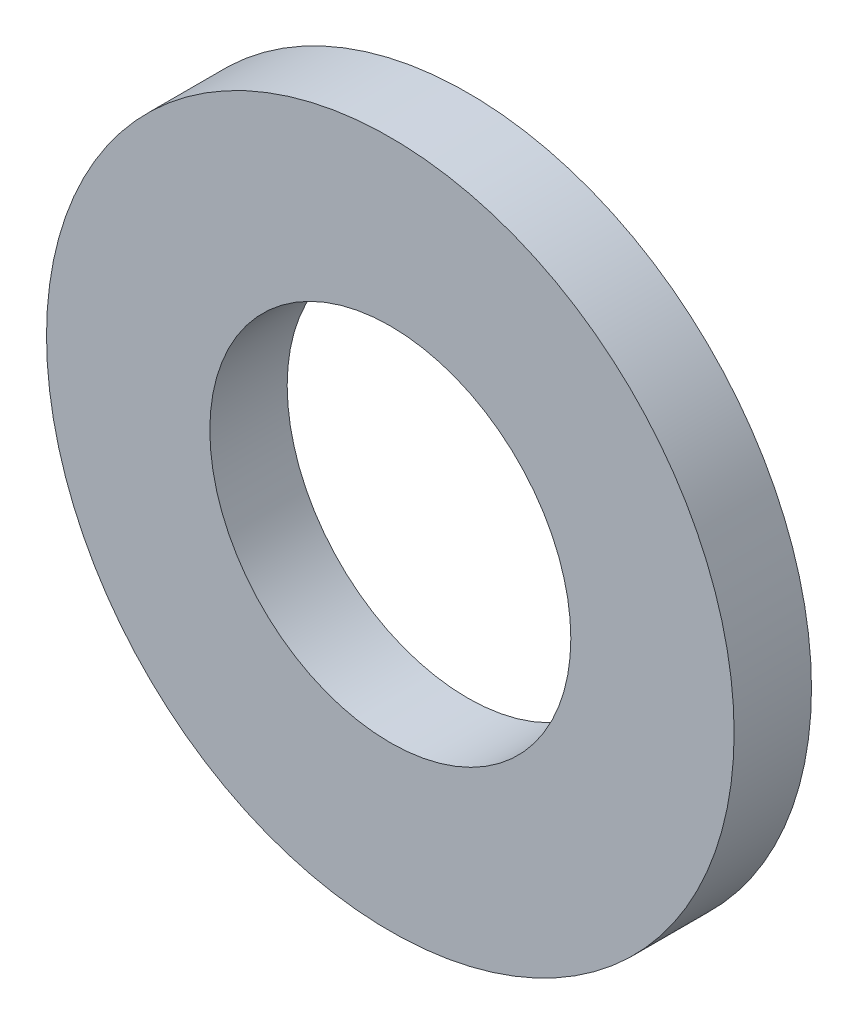
ISO-10303-21;
HEADER;
FILE_DESCRIPTION(('STEP AP214'),'2;1');
FILE_NAME('part.step','',(''),(''),'','','');
FILE_SCHEMA(('AUTOMOTIVE_DESIGN { 1 0 10303 214 1 1 1 1 }'));
ENDSEC;
DATA;
#1=APPLICATION_CONTEXT('core data for automotive mechanical design processes');
#2=APPLICATION_PROTOCOL_DEFINITION('international standard','automotive_design',2000,#1);
#3=PRODUCT_CONTEXT('',#1,'mechanical');
#4=PRODUCT('Part','Part','',(#3));
#5=PRODUCT_RELATED_PRODUCT_CATEGORY('part','',(#4));
#6=PRODUCT_DEFINITION_FORMATION('','',#4);
#7=PRODUCT_DEFINITION_CONTEXT('part definition',#1,'design');
#8=PRODUCT_DEFINITION('design','',#6,#7);
#9=PRODUCT_DEFINITION_SHAPE('','',#8);
#10=(LENGTH_UNIT() NAMED_UNIT(*) SI_UNIT(.MILLI.,.METRE.));
#11=(NAMED_UNIT(*) PLANE_ANGLE_UNIT() SI_UNIT($,.RADIAN.));
#12=(NAMED_UNIT(*) SI_UNIT($,.STERADIAN.) SOLID_ANGLE_UNIT());
#13=UNCERTAINTY_MEASURE_WITH_UNIT(LENGTH_MEASURE(1.E-05),#10,'distance_accuracy_value','');
#14=(GEOMETRIC_REPRESENTATION_CONTEXT(3) GLOBAL_UNCERTAINTY_ASSIGNED_CONTEXT((#13)) GLOBAL_UNIT_ASSIGNED_CONTEXT((#10,
#11,#12)) REPRESENTATION_CONTEXT('',''));
#15=CARTESIAN_POINT('',(0.,0.,0.));
#16=DIRECTION('',(0.,0.,1.));
#17=DIRECTION('',(1.,0.,0.));
#18=AXIS2_PLACEMENT_3D('',#15,#16,#17);
#19=CARTESIAN_POINT('',(0.,0.,1.8));
#20=DIRECTION('',(0.,0.,1.));
#21=DIRECTION('',(1.,0.,0.));
#22=AXIS2_PLACEMENT_3D('',#19,#20,#21);
#23=PLANE('',#22);
#24=CARTESIAN_POINT('',(0.,0.,1.8));
#25=DIRECTION('',(0.,0.,1.));
#26=DIRECTION('',(1.,0.,0.));
#27=AXIS2_PLACEMENT_3D('',#24,#25,#26);
#28=CIRCLE('',#27,8.);
#29=CARTESIAN_POINT('',(8.,0.,1.8));
#30=VERTEX_POINT('',#29);
#31=EDGE_CURVE('E10',#30,#30,#28,.T.);
#32=ORIENTED_EDGE('',*,*,#31,.T.);
#33=EDGE_LOOP('',(#32));
#34=FACE_BOUND('',#33,.T.);
#35=CARTESIAN_POINT('',(0.,0.,1.8));
#36=DIRECTION('',(0.,0.,1.));
#37=DIRECTION('',(1.,0.,0.));
#38=AXIS2_PLACEMENT_3D('',#35,#36,#37);
#39=CIRCLE('',#38,4.2);
#40=CARTESIAN_POINT('',(4.2,0.,1.8));
#41=VERTEX_POINT('',#40);
#42=EDGE_CURVE('E48',#41,#41,#39,.T.);
#43=ORIENTED_EDGE('',*,*,#42,.F.);
#44=EDGE_LOOP('',(#43));
#45=FACE_BOUND('',#44,.T.);
#46=ADVANCED_FACE('F37',(#34,#45),#23,.T.);
#47=CARTESIAN_POINT('',(0.,0.,0.));
#48=DIRECTION('',(0.,0.,1.));
#49=DIRECTION('',(1.,0.,0.));
#50=AXIS2_PLACEMENT_3D('',#47,#48,#49);
#51=PLANE('',#50);
#52=CARTESIAN_POINT('',(0.,0.,0.));
#53=DIRECTION('',(0.,0.,1.));
#54=DIRECTION('',(1.,0.,0.));
#55=AXIS2_PLACEMENT_3D('',#52,#53,#54);
#56=CIRCLE('',#55,8.);
#57=CARTESIAN_POINT('',(8.,0.,0.));
#58=VERTEX_POINT('',#57);
#59=EDGE_CURVE('E41',#58,#58,#56,.T.);
#60=ORIENTED_EDGE('',*,*,#59,.F.);
#61=EDGE_LOOP('',(#60));
#62=FACE_BOUND('',#61,.T.);
#63=CARTESIAN_POINT('',(0.,0.,0.));
#64=DIRECTION('',(0.,0.,1.));
#65=DIRECTION('',(1.,0.,0.));
#66=AXIS2_PLACEMENT_3D('',#63,#64,#65);
#67=CIRCLE('',#66,4.2);
#68=CARTESIAN_POINT('',(4.2,0.,0.));
#69=VERTEX_POINT('',#68);
#70=EDGE_CURVE('E50',#69,#69,#67,.T.);
#71=ORIENTED_EDGE('',*,*,#70,.T.);
#72=EDGE_LOOP('',(#71));
#73=FACE_BOUND('',#72,.T.);
#74=ADVANCED_FACE('F60',(#62,#73),#51,.F.);
#75=CARTESIAN_POINT('',(0.,0.,1.8));
#76=DIRECTION('',(0.,0.,-1.));
#77=DIRECTION('',(-1.,0.,0.));
#78=AXIS2_PLACEMENT_3D('',#75,#76,#77);
#79=CYLINDRICAL_SURFACE('',#78,8.);
#80=ORIENTED_EDGE('',*,*,#31,.F.);
#81=EDGE_LOOP('',(#80));
#82=FACE_BOUND('',#81,.T.);
#83=ORIENTED_EDGE('',*,*,#59,.T.);
#84=EDGE_LOOP('',(#83));
#85=FACE_BOUND('',#84,.T.);
#86=ADVANCED_FACE('F39',(#82,#85),#79,.T.);
#87=CARTESIAN_POINT('',(0.,0.,1.8));
#88=DIRECTION('',(0.,0.,-1.));
#89=DIRECTION('',(-1.,0.,0.));
#90=AXIS2_PLACEMENT_3D('',#87,#88,#89);
#91=CYLINDRICAL_SURFACE('',#90,4.2);
#92=ORIENTED_EDGE('',*,*,#42,.T.);
#93=EDGE_LOOP('',(#92));
#94=FACE_BOUND('',#93,.T.);
#95=ORIENTED_EDGE('',*,*,#70,.F.);
#96=EDGE_LOOP('',(#95));
#97=FACE_BOUND('',#96,.T.);
#98=ADVANCED_FACE('F56',(#94,#97),#91,.F.);
#99=CLOSED_SHELL('',(#46,#74,#86,#98));
#100=MANIFOLD_SOLID_BREP('B2',#99);
#101=ADVANCED_BREP_SHAPE_REPRESENTATION('',(#18,#100),#14);
#102=SHAPE_DEFINITION_REPRESENTATION(#9,#101);
ENDSEC;
END-ISO-10303-21;
